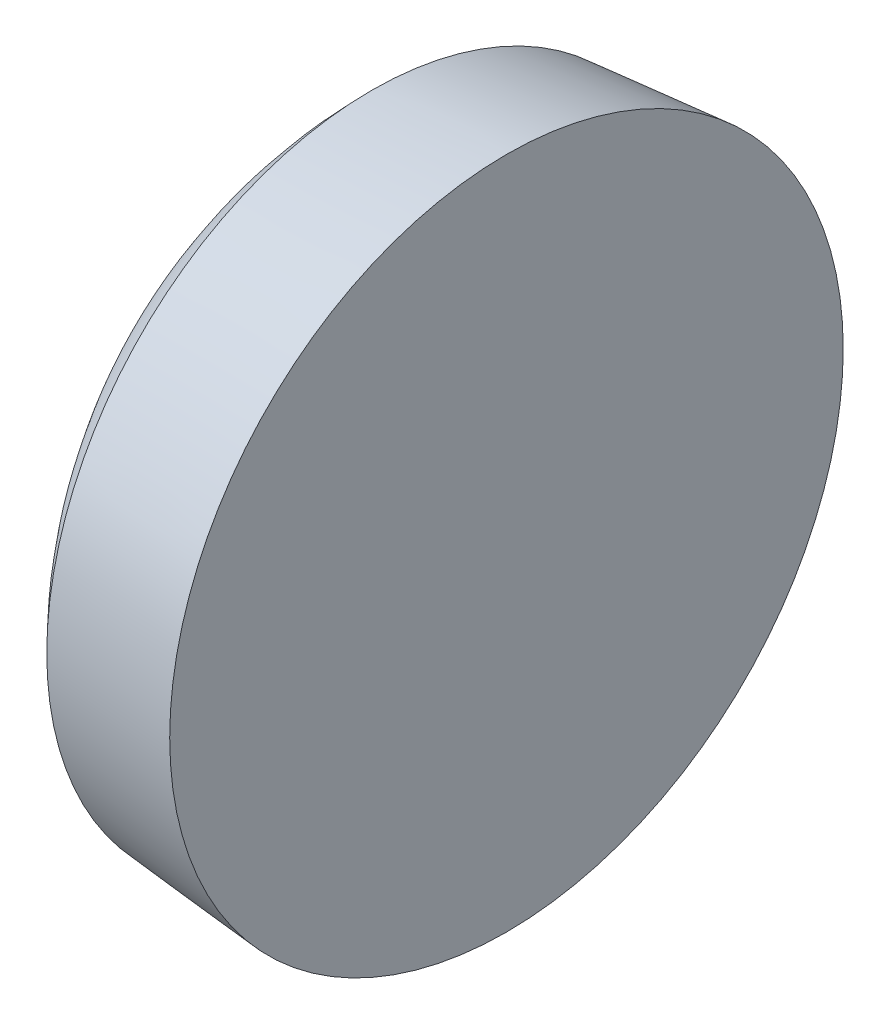
ISO-10303-21;
HEADER;
FILE_DESCRIPTION(('STEP AP214'),'2;1');
FILE_NAME('part.step','',(''),(''),'','','');
FILE_SCHEMA(('AUTOMOTIVE_DESIGN { 1 0 10303 214 1 1 1 1 }'));
ENDSEC;
DATA;
#1=APPLICATION_CONTEXT('core data for automotive mechanical design processes');
#2=APPLICATION_PROTOCOL_DEFINITION('international standard','automotive_design',2000,#1);
#3=PRODUCT_CONTEXT('',#1,'mechanical');
#4=PRODUCT('Part','Part','',(#3));
#5=PRODUCT_RELATED_PRODUCT_CATEGORY('part','',(#4));
#6=PRODUCT_DEFINITION_FORMATION('','',#4);
#7=PRODUCT_DEFINITION_CONTEXT('part definition',#1,'design');
#8=PRODUCT_DEFINITION('design','',#6,#7);
#9=PRODUCT_DEFINITION_SHAPE('','',#8);
#10=(LENGTH_UNIT() NAMED_UNIT(*) SI_UNIT(.MILLI.,.METRE.));
#11=(NAMED_UNIT(*) PLANE_ANGLE_UNIT() SI_UNIT($,.RADIAN.));
#12=(NAMED_UNIT(*) SI_UNIT($,.STERADIAN.) SOLID_ANGLE_UNIT());
#13=UNCERTAINTY_MEASURE_WITH_UNIT(LENGTH_MEASURE(1.E-05),#10,'distance_accuracy_value','');
#14=(GEOMETRIC_REPRESENTATION_CONTEXT(3) GLOBAL_UNCERTAINTY_ASSIGNED_CONTEXT((#13)) GLOBAL_UNIT_ASSIGNED_CONTEXT((#10,
#11,#12)) REPRESENTATION_CONTEXT('',''));
#15=CARTESIAN_POINT('',(0.,0.,0.));
#16=DIRECTION('',(0.,0.,1.));
#17=DIRECTION('',(1.,0.,0.));
#18=AXIS2_PLACEMENT_3D('',#15,#16,#17);
#19=CARTESIAN_POINT('',(183.433333333333,6.9,10.));
#20=DIRECTION('',(-1.,0.,0.));
#21=DIRECTION('',(0.,0.,1.));
#22=AXIS2_PLACEMENT_3D('',#19,#20,#21);
#23=PLANE('',#22);
#24=DIRECTION('',(0.,0.,-1.));
#25=VECTOR('',#24,1.);
#26=CARTESIAN_POINT('',(183.433333333333,7.85,10.));
#27=LINE('',#26,#25);
#28=CARTESIAN_POINT('',(183.433333333333,7.85,9.82));
#29=VERTEX_POINT('',#28);
#30=CARTESIAN_POINT('',(183.433333333333,7.85,10.18));
#31=VERTEX_POINT('',#30);
#32=EDGE_CURVE('E293',#29,#31,#27,.F.);
#33=ORIENTED_EDGE('',*,*,#32,.F.);
#34=DIRECTION('',(0.,1.,0.));
#35=VECTOR('',#34,1.);
#36=CARTESIAN_POINT('',(183.433333333333,6.9,9.82));
#37=LINE('',#36,#35);
#38=CARTESIAN_POINT('',(183.433333333333,7.08,9.82));
#39=VERTEX_POINT('',#38);
#40=EDGE_CURVE('E298',#39,#29,#37,.T.);
#41=ORIENTED_EDGE('',*,*,#40,.F.);
#42=DIRECTION('',(0.,0.,-1.));
#43=VECTOR('',#42,1.);
#44=CARTESIAN_POINT('',(183.433333333333,7.08,10.));
#45=LINE('',#44,#43);
#46=CARTESIAN_POINT('',(183.433333333333,7.08,9.05));
#47=VERTEX_POINT('',#46);
#48=EDGE_CURVE('E303',#47,#39,#45,.F.);
#49=ORIENTED_EDGE('',*,*,#48,.F.);
#50=DIRECTION('',(0.,1.,0.));
#51=VECTOR('',#50,1.);
#52=CARTESIAN_POINT('',(183.433333333333,6.9,9.05));
#53=LINE('',#52,#51);
#54=CARTESIAN_POINT('',(183.433333333333,6.72,9.05));
#55=VERTEX_POINT('',#54);
#56=EDGE_CURVE('E308',#55,#47,#53,.T.);
#57=ORIENTED_EDGE('',*,*,#56,.F.);
#58=DIRECTION('',(0.,0.,1.));
#59=VECTOR('',#58,1.);
#60=CARTESIAN_POINT('',(183.433333333333,6.72,10.));
#61=LINE('',#60,#59);
#62=CARTESIAN_POINT('',(183.433333333333,6.72,9.82));
#63=VERTEX_POINT('',#62);
#64=EDGE_CURVE('E313',#63,#55,#61,.F.);
#65=ORIENTED_EDGE('',*,*,#64,.F.);
#66=DIRECTION('',(0.,1.,0.));
#67=VECTOR('',#66,1.);
#68=CARTESIAN_POINT('',(183.433333333333,6.9,9.82));
#69=LINE('',#68,#67);
#70=CARTESIAN_POINT('',(183.433333333333,5.95,9.82));
#71=VERTEX_POINT('',#70);
#72=EDGE_CURVE('E318',#71,#63,#69,.T.);
#73=ORIENTED_EDGE('',*,*,#72,.F.);
#74=DIRECTION('',(0.,0.,-1.));
#75=VECTOR('',#74,1.);
#76=CARTESIAN_POINT('',(183.433333333333,5.95,10.));
#77=LINE('',#76,#75);
#78=CARTESIAN_POINT('',(183.433333333333,5.95,10.18));
#79=VERTEX_POINT('',#78);
#80=EDGE_CURVE('E267',#71,#79,#77,.F.);
#81=ORIENTED_EDGE('',*,*,#80,.T.);
#82=DIRECTION('',(0.,1.,0.));
#83=VECTOR('',#82,1.);
#84=CARTESIAN_POINT('',(183.433333333333,6.9,10.18));
#85=LINE('',#84,#83);
#86=CARTESIAN_POINT('',(183.433333333333,6.72,10.18));
#87=VERTEX_POINT('',#86);
#88=EDGE_CURVE('E264',#87,#79,#85,.F.);
#89=ORIENTED_EDGE('',*,*,#88,.F.);
#90=DIRECTION('',(0.,0.,1.));
#91=VECTOR('',#90,1.);
#92=CARTESIAN_POINT('',(183.433333333333,6.72,10.));
#93=LINE('',#92,#91);
#94=CARTESIAN_POINT('',(183.433333333333,6.72,10.95));
#95=VERTEX_POINT('',#94);
#96=EDGE_CURVE('E260',#95,#87,#93,.F.);
#97=ORIENTED_EDGE('',*,*,#96,.F.);
#98=DIRECTION('',(0.,1.,0.));
#99=VECTOR('',#98,1.);
#100=CARTESIAN_POINT('',(183.433333333333,6.9,10.95));
#101=LINE('',#100,#99);
#102=CARTESIAN_POINT('',(183.433333333333,7.08,10.95));
#103=VERTEX_POINT('',#102);
#104=EDGE_CURVE('E231',#95,#103,#101,.T.);
#105=ORIENTED_EDGE('',*,*,#104,.T.);
#106=DIRECTION('',(0.,0.,-1.));
#107=VECTOR('',#106,1.);
#108=CARTESIAN_POINT('',(183.433333333333,7.08,10.));
#109=LINE('',#108,#107);
#110=CARTESIAN_POINT('',(183.433333333333,7.08,10.18));
#111=VERTEX_POINT('',#110);
#112=EDGE_CURVE('E278',#111,#103,#109,.F.);
#113=ORIENTED_EDGE('',*,*,#112,.F.);
#114=DIRECTION('',(0.,1.,0.));
#115=VECTOR('',#114,1.);
#116=CARTESIAN_POINT('',(183.433333333333,6.9,10.18));
#117=LINE('',#116,#115);
#118=EDGE_CURVE('E288',#31,#111,#117,.F.);
#119=ORIENTED_EDGE('',*,*,#118,.F.);
#120=EDGE_LOOP('',(#33,#41,#49,#57,#65,#73,#81,#89,#97,#105,#113,#119));
#121=FACE_BOUND('',#120,.T.);
#122=ADVANCED_FACE('F17',(#121),#23,.T.);
#123=CARTESIAN_POINT('',(182.833333333333,6.72,10.));
#124=DIRECTION('',(0.,1.,0.));
#125=DIRECTION('',(0.,0.,1.));
#126=AXIS2_PLACEMENT_3D('',#123,#124,#125);
#127=PLANE('',#126);
#128=DIRECTION('',(1.,0.,0.));
#129=VECTOR('',#128,1.);
#130=CARTESIAN_POINT('',(182.833333333333,6.72,10.95));
#131=LINE('',#130,#129);
#132=CARTESIAN_POINT('',(182.410428810142,6.72,10.9499999999999));
#133=VERTEX_POINT('',#132);
#134=EDGE_CURVE('E89',#133,#95,#131,.T.);
#135=ORIENTED_EDGE('',*,*,#134,.T.);
#136=ORIENTED_EDGE('',*,*,#96,.T.);
#137=DIRECTION('',(-1.,0.,0.));
#138=VECTOR('',#137,1.);
#139=CARTESIAN_POINT('',(182.833333333333,6.72,10.18));
#140=LINE('',#139,#138);
#141=CARTESIAN_POINT('',(182.245235763539,6.72000000000002,10.18));
#142=VERTEX_POINT('',#141);
#143=EDGE_CURVE('E224',#142,#87,#140,.F.);
#144=ORIENTED_EDGE('',*,*,#143,.F.);
#145=CARTESIAN_POINT('',(182.410428810142,6.72,10.9499999999998));
#146=CARTESIAN_POINT('',(182.398883795949,6.72,10.9189995540504));
#147=CARTESIAN_POINT('',(182.387904413565,6.72,10.8877884938066));
#148=CARTESIAN_POINT('',(182.367131215027,6.72,10.8251104536467));
#149=CARTESIAN_POINT('',(182.357332908016,6.72,10.7936449620739));
#150=CARTESIAN_POINT('',(182.338909367376,6.72,10.7304618501355));
#151=CARTESIAN_POINT('',(182.330281127747,6.72,10.6987451062671));
#152=CARTESIAN_POINT('',(182.31418937858,6.72,10.6350619663154));
#153=CARTESIAN_POINT('',(182.306724349758,6.72,10.6030959541241));
#154=CARTESIAN_POINT('',(182.292955171372,6.72,10.5389148788567));
#155=CARTESIAN_POINT('',(182.286651021807,6.72,10.5066998157807));
#156=CARTESIAN_POINT('',(182.275204274441,6.72,10.4420201537523));
#157=CARTESIAN_POINT('',(182.270063219696,6.72,10.4095552817085));
#158=CARTESIAN_POINT('',(182.260948171023,6.72,10.3443751591892));
#159=CARTESIAN_POINT('',(182.256977278094,6.72,10.3116594750372));
#160=CARTESIAN_POINT('',(182.250212291185,6.72,10.2459761632456));
#161=CARTESIAN_POINT('',(182.247422903366,6.72,10.2130080508537));
#162=CARTESIAN_POINT('',(182.24523576354,6.72,10.18));
#163=B_SPLINE_CURVE_WITH_KNOTS('',3,(#145,#146,#147,#148,#149,#150,#151,#152,#153,#154,#155,
#156,#157,#158,#159,#160,#161,#162),.UNSPECIFIED.,.F.,.F.,(4,2,2,2,2,2,2,2,4),(0.,
0.099235744243404,0.198081387639238,0.296668072480432,0.39512489269402,0.493581712907609,
0.592168397748812,0.691014041144643,0.790249785388046),.UNSPECIFIED.);
#164=EDGE_CURVE('E20',#133,#142,#163,.T.);
#165=ORIENTED_EDGE('',*,*,#164,.F.);
#166=EDGE_LOOP('',(#135,#136,#144,#165));
#167=FACE_BOUND('',#166,.T.);
#168=ADVANCED_FACE('F221',(#167),#127,.T.);
#169=CARTESIAN_POINT('',(182.833333333333,6.9,10.18));
#170=DIRECTION('',(0.,0.,-1.));
#171=DIRECTION('',(-1.,0.,0.));
#172=AXIS2_PLACEMENT_3D('',#169,#170,#171);
#173=PLANE('',#172);
#174=ORIENTED_EDGE('',*,*,#88,.T.);
#175=DIRECTION('',(1.,0.,0.));
#176=VECTOR('',#175,1.);
#177=CARTESIAN_POINT('',(182.833333333333,5.95,10.18));
#178=LINE('',#177,#176);
#179=CARTESIAN_POINT('',(182.410428810142,5.95,10.18));
#180=VERTEX_POINT('',#179);
#181=EDGE_CURVE('E324',#79,#180,#178,.F.);
#182=ORIENTED_EDGE('',*,*,#181,.T.);
#183=CARTESIAN_POINT('',(182.24523576354,6.72000000000004,10.18));
#184=CARTESIAN_POINT('',(182.250889942228,6.63440991744424,10.18));
#185=CARTESIAN_POINT('',(182.260621429629,6.54909652262238,10.18));
#186=CARTESIAN_POINT('',(182.287988547145,6.3803409384024,10.18));
#187=CARTESIAN_POINT('',(182.305570101184,6.29688998051813,10.18));
#188=CARTESIAN_POINT('',(182.350299230746,6.12495750840967,10.18));
#189=CARTESIAN_POINT('',(182.378135293842,6.0366546889967,10.18));
#190=CARTESIAN_POINT('',(182.410428810142,5.95000000000018,10.18));
#191=B_SPLINE_CURVE_WITH_KNOTS('',3,(#183,#184,#185,#186,#187,#188,#189,#190),.UNSPECIFIED.,.F.,
.F.,(4,2,2,4),(0.,0.25722165882931,0.512698117737291,0.789983486231456),.UNSPECIFIED.);
#192=EDGE_CURVE('E213',#142,#180,#191,.T.);
#193=ORIENTED_EDGE('',*,*,#192,.F.);
#194=ORIENTED_EDGE('',*,*,#143,.T.);
#195=EDGE_LOOP('',(#174,#182,#193,#194));
#196=FACE_BOUND('',#195,.T.);
#197=ADVANCED_FACE('F204',(#196),#173,.T.);
#198=CARTESIAN_POINT('',(182.833333333333,5.95,10.));
#199=DIRECTION('',(0.,-1.,0.));
#200=DIRECTION('',(0.,0.,-1.));
#201=AXIS2_PLACEMENT_3D('',#198,#199,#200);
#202=PLANE('',#201);
#203=ORIENTED_EDGE('',*,*,#181,.F.);
#204=ORIENTED_EDGE('',*,*,#80,.F.);
#205=DIRECTION('',(1.,0.,0.));
#206=VECTOR('',#205,1.);
#207=CARTESIAN_POINT('',(182.833333333333,5.95,9.82));
#208=LINE('',#207,#206);
#209=CARTESIAN_POINT('',(182.410428810142,5.95000000000009,9.82));
#210=VERTEX_POINT('',#209);
#211=EDGE_CURVE('E320',#210,#71,#208,.T.);
#212=ORIENTED_EDGE('',*,*,#211,.F.);
#213=CARTESIAN_POINT('',(182.410428810143,5.95,10.18));
#214=CARTESIAN_POINT('',(182.406200414444,5.94999999999998,10.12));
#215=CARTESIAN_POINT('',(182.404086216595,5.94999999999998,10.06));
#216=CARTESIAN_POINT('',(182.404086216595,5.95000000000002,9.93999999999997));
#217=CARTESIAN_POINT('',(182.406200414444,5.95000000000006,9.87999999999998));
#218=CARTESIAN_POINT('',(182.410428810143,5.95000000000011,9.81999999999998));
#219=B_SPLINE_CURVE_WITH_KNOTS('',3,(#213,#214,#215,#216,#217,#218),.UNSPECIFIED.,.F.,.F.,(4,2,
4),(0.,0.180111711148681,0.36022342229736),.UNSPECIFIED.);
#220=EDGE_CURVE('E207',#180,#210,#219,.T.);
#221=ORIENTED_EDGE('',*,*,#220,.F.);
#222=EDGE_LOOP('',(#203,#204,#212,#221));
#223=FACE_BOUND('',#222,.T.);
#224=ADVANCED_FACE('F199',(#223),#202,.F.);
#225=CARTESIAN_POINT('',(182.833333333333,6.9,9.82));
#226=DIRECTION('',(0.,0.,1.));
#227=DIRECTION('',(1.,0.,0.));
#228=AXIS2_PLACEMENT_3D('',#225,#226,#227);
#229=PLANE('',#228);
#230=ORIENTED_EDGE('',*,*,#72,.T.);
#231=DIRECTION('',(1.,0.,0.));
#232=VECTOR('',#231,1.);
#233=CARTESIAN_POINT('',(182.833333333333,6.72,9.82));
#234=LINE('',#233,#232);
#235=CARTESIAN_POINT('',(182.245235763539,6.72,9.82000000000002));
#236=VERTEX_POINT('',#235);
#237=EDGE_CURVE('E315',#236,#63,#234,.T.);
#238=ORIENTED_EDGE('',*,*,#237,.F.);
#239=CARTESIAN_POINT('',(182.410428810142,5.95000000000019,9.82));
#240=CARTESIAN_POINT('',(182.398883795949,5.9810004459496,9.82));
#241=CARTESIAN_POINT('',(182.387904413565,6.01221150619345,9.82));
#242=CARTESIAN_POINT('',(182.367131215027,6.07488954635332,9.82));
#243=CARTESIAN_POINT('',(182.357332908016,6.10635503792611,9.82));
#244=CARTESIAN_POINT('',(182.338909367376,6.16953814986455,9.82));
#245=CARTESIAN_POINT('',(182.330281127747,6.2012548937329,9.82));
#246=CARTESIAN_POINT('',(182.31418937858,6.26493803368462,9.82));
#247=CARTESIAN_POINT('',(182.306724349758,6.29690404587594,9.82));
#248=CARTESIAN_POINT('',(182.292955171372,6.36108512114329,9.82));
#249=CARTESIAN_POINT('',(182.286651021807,6.39330018421931,9.82));
#250=CARTESIAN_POINT('',(182.275204274441,6.4579798462477,9.82));
#251=CARTESIAN_POINT('',(182.270063219696,6.49044471829152,9.82));
#252=CARTESIAN_POINT('',(182.260948171023,6.55562484081075,9.82));
#253=CARTESIAN_POINT('',(182.256977278094,6.58834052496283,9.82));
#254=CARTESIAN_POINT('',(182.250212291185,6.65402383675445,9.82));
#255=CARTESIAN_POINT('',(182.247422903366,6.68699194914626,9.82));
#256=CARTESIAN_POINT('',(182.24523576354,6.72000000000004,9.82));
#257=B_SPLINE_CURVE_WITH_KNOTS('',3,(#239,#240,#241,#242,#243,#244,#245,#246,#247,#248,#249,
#250,#251,#252,#253,#254,#255,#256),.UNSPECIFIED.,.F.,.F.,(4,2,2,2,2,2,2,2,4),(0.,
0.0992357442434024,0.198081387639237,0.296668072480432,0.395124892694019,0.493581712907605,
0.592168397748808,0.69101404114464,0.790249785388043),.UNSPECIFIED.);
#258=EDGE_CURVE('E184',#210,#236,#257,.T.);
#259=ORIENTED_EDGE('',*,*,#258,.F.);
#260=ORIENTED_EDGE('',*,*,#211,.T.);
#261=EDGE_LOOP('',(#230,#238,#259,#260));
#262=FACE_BOUND('',#261,.T.);
#263=ADVANCED_FACE('F194',(#262),#229,.T.);
#264=CARTESIAN_POINT('',(182.833333333333,6.72,10.));
#265=DIRECTION('',(0.,1.,0.));
#266=DIRECTION('',(0.,0.,1.));
#267=AXIS2_PLACEMENT_3D('',#264,#265,#266);
#268=PLANE('',#267);
#269=DIRECTION('',(1.,0.,0.));
#270=VECTOR('',#269,1.);
#271=CARTESIAN_POINT('',(182.833333333333,6.72,9.05));
#272=LINE('',#271,#270);
#273=CARTESIAN_POINT('',(182.410428810142,6.72,9.05));
#274=VERTEX_POINT('',#273);
#275=EDGE_CURVE('E310',#274,#55,#272,.T.);
#276=ORIENTED_EDGE('',*,*,#275,.F.);
#277=CARTESIAN_POINT('',(182.24523576354,6.72,9.82000000000004));
#278=CARTESIAN_POINT('',(182.250889942228,6.72,9.73440991744424));
#279=CARTESIAN_POINT('',(182.260621429629,6.72,9.64909652262238));
#280=CARTESIAN_POINT('',(182.287988547145,6.72,9.4803409384024));
#281=CARTESIAN_POINT('',(182.305570101184,6.72,9.39688998051814));
#282=CARTESIAN_POINT('',(182.350299230746,6.72,9.22495750840967));
#283=CARTESIAN_POINT('',(182.378135293842,6.72,9.1366546889967));
#284=CARTESIAN_POINT('',(182.410428810142,6.72,9.05000000000018));
#285=B_SPLINE_CURVE_WITH_KNOTS('',3,(#277,#278,#279,#280,#281,#282,#283,#284),.UNSPECIFIED.,.F.,
.F.,(4,2,2,4),(0.,0.257221658829309,0.51269811773729,0.78998348623146),.UNSPECIFIED.);
#286=EDGE_CURVE('E176',#236,#274,#285,.T.);
#287=ORIENTED_EDGE('',*,*,#286,.F.);
#288=ORIENTED_EDGE('',*,*,#237,.T.);
#289=ORIENTED_EDGE('',*,*,#64,.T.);
#290=EDGE_LOOP('',(#276,#287,#288,#289));
#291=FACE_BOUND('',#290,.T.);
#292=ADVANCED_FACE('F191',(#291),#268,.T.);
#293=CARTESIAN_POINT('',(182.833333333333,6.9,9.05));
#294=DIRECTION('',(0.,0.,1.));
#295=DIRECTION('',(1.,0.,0.));
#296=AXIS2_PLACEMENT_3D('',#293,#294,#295);
#297=PLANE('',#296);
#298=DIRECTION('',(1.,0.,0.));
#299=VECTOR('',#298,1.);
#300=CARTESIAN_POINT('',(182.833333333333,7.08,9.05));
#301=LINE('',#300,#299);
#302=CARTESIAN_POINT('',(182.410428810142,7.08,9.05000000000009));
#303=VERTEX_POINT('',#302);
#304=EDGE_CURVE('E305',#303,#47,#301,.T.);
#305=ORIENTED_EDGE('',*,*,#304,.F.);
#306=CARTESIAN_POINT('',(182.410428810142,7.08,9.05));
#307=CARTESIAN_POINT('',(182.404086216595,6.99011174581245,9.05));
#308=CARTESIAN_POINT('',(182.404086216595,6.9,9.05));
#309=B_SPLINE_CURVE_WITH_KNOTS('',2,(#306,#307,#308),.UNSPECIFIED.,.F.,.F.,(3,3),(0.,1.),.UNSPECIFIED.);
#310=CARTESIAN_POINT('',(182.404086216595,6.9,9.05));
#311=VERTEX_POINT('',#310);
#312=EDGE_CURVE('E175',#311,#303,#309,.F.);
#313=ORIENTED_EDGE('',*,*,#312,.F.);
#314=CARTESIAN_POINT('',(182.404086216595,6.9,9.05));
#315=CARTESIAN_POINT('',(182.404086216595,6.80988825418755,9.05));
#316=CARTESIAN_POINT('',(182.410428810142,6.72,9.05));
#317=B_SPLINE_CURVE_WITH_KNOTS('',2,(#314,#315,#316),.UNSPECIFIED.,.F.,.F.,(3,3),(0.,1.),.UNSPECIFIED.);
#318=EDGE_CURVE('E183',#274,#311,#317,.F.);
#319=ORIENTED_EDGE('',*,*,#318,.F.);
#320=ORIENTED_EDGE('',*,*,#275,.T.);
#321=ORIENTED_EDGE('',*,*,#56,.T.);
#322=EDGE_LOOP('',(#305,#313,#319,#320,#321));
#323=FACE_BOUND('',#322,.T.);
#324=ADVANCED_FACE('F164',(#323),#297,.T.);
#325=CARTESIAN_POINT('',(182.833333333333,7.08,10.));
#326=DIRECTION('',(0.,-1.,0.));
#327=DIRECTION('',(0.,0.,-1.));
#328=AXIS2_PLACEMENT_3D('',#325,#326,#327);
#329=PLANE('',#328);
#330=ORIENTED_EDGE('',*,*,#304,.T.);
#331=ORIENTED_EDGE('',*,*,#48,.T.);
#332=DIRECTION('',(1.,0.,0.));
#333=VECTOR('',#332,1.);
#334=CARTESIAN_POINT('',(182.833333333333,7.08,9.82));
#335=LINE('',#334,#333);
#336=CARTESIAN_POINT('',(182.245235763539,7.07999999999998,9.82));
#337=VERTEX_POINT('',#336);
#338=EDGE_CURVE('E300',#337,#39,#335,.T.);
#339=ORIENTED_EDGE('',*,*,#338,.F.);
#340=CARTESIAN_POINT('',(182.410428810142,7.08,9.05000000000018));
#341=CARTESIAN_POINT('',(182.398883795949,7.08,9.08100044594959));
#342=CARTESIAN_POINT('',(182.387904413565,7.08,9.11221150619344));
#343=CARTESIAN_POINT('',(182.367131215027,7.08,9.17488954635332));
#344=CARTESIAN_POINT('',(182.357332908016,7.08,9.20635503792611));
#345=CARTESIAN_POINT('',(182.338909367376,7.08,9.26953814986455));
#346=CARTESIAN_POINT('',(182.330281127747,7.08,9.30125489373289));
#347=CARTESIAN_POINT('',(182.31418937858,7.08,9.36493803368462));
#348=CARTESIAN_POINT('',(182.306724349758,7.08,9.39690404587594));
#349=CARTESIAN_POINT('',(182.292955171372,7.08,9.46108512114328));
#350=CARTESIAN_POINT('',(182.286651021807,7.08,9.49330018421931));
#351=CARTESIAN_POINT('',(182.275204274441,7.08,9.5579798462477));
#352=CARTESIAN_POINT('',(182.270063219696,7.08,9.59044471829151));
#353=CARTESIAN_POINT('',(182.260948171023,7.08,9.65562484081075));
#354=CARTESIAN_POINT('',(182.256977278094,7.08,9.68834052496283));
#355=CARTESIAN_POINT('',(182.250212291185,7.08,9.75402383675445));
#356=CARTESIAN_POINT('',(182.247422903366,7.08,9.78699194914626));
#357=CARTESIAN_POINT('',(182.24523576354,7.08,9.82000000000004));
#358=B_SPLINE_CURVE_WITH_KNOTS('',3,(#340,#341,#342,#343,#344,#345,#346,#347,#348,#349,#350,
#351,#352,#353,#354,#355,#356,#357),.UNSPECIFIED.,.F.,.F.,(4,2,2,2,2,2,2,2,4),(0.,
0.099235744243404,0.198081387639237,0.296668072480432,0.395124892694019,0.493581712907607,
0.59216839774881,0.691014041144642,0.790249785388045),.UNSPECIFIED.);
#359=EDGE_CURVE('E168',#303,#337,#358,.T.);
#360=ORIENTED_EDGE('',*,*,#359,.F.);
#361=EDGE_LOOP('',(#330,#331,#339,#360));
#362=FACE_BOUND('',#361,.T.);
#363=ADVANCED_FACE('F159',(#362),#329,.T.);
#364=CARTESIAN_POINT('',(182.833333333333,6.9,9.82));
#365=DIRECTION('',(0.,0.,1.));
#366=DIRECTION('',(1.,0.,0.));
#367=AXIS2_PLACEMENT_3D('',#364,#365,#366);
#368=PLANE('',#367);
#369=ORIENTED_EDGE('',*,*,#40,.T.);
#370=DIRECTION('',(1.,0.,0.));
#371=VECTOR('',#370,1.);
#372=CARTESIAN_POINT('',(182.833333333333,7.85,9.82));
#373=LINE('',#372,#371);
#374=CARTESIAN_POINT('',(182.410428810142,7.85,9.82000000000002));
#375=VERTEX_POINT('',#374);
#376=EDGE_CURVE('E295',#375,#29,#373,.T.);
#377=ORIENTED_EDGE('',*,*,#376,.F.);
#378=CARTESIAN_POINT('',(182.24523576354,7.07999999999996,9.82));
#379=CARTESIAN_POINT('',(182.250889942228,7.16559008255576,9.82));
#380=CARTESIAN_POINT('',(182.260621429629,7.25090347737762,9.82));
#381=CARTESIAN_POINT('',(182.287988547145,7.4196590615976,9.82));
#382=CARTESIAN_POINT('',(182.305570101184,7.50311001948186,9.82));
#383=CARTESIAN_POINT('',(182.350299230746,7.67504249159033,9.82));
#384=CARTESIAN_POINT('',(182.378135293842,7.7633453110033,9.82));
#385=CARTESIAN_POINT('',(182.410428810142,7.84999999999982,9.82));
#386=B_SPLINE_CURVE_WITH_KNOTS('',3,(#378,#379,#380,#381,#382,#383,#384,#385),.UNSPECIFIED.,.F.,
.F.,(4,2,2,4),(0.,0.25722165882931,0.51269811773729,0.789983486231458),.UNSPECIFIED.);
#387=EDGE_CURVE('E144',#337,#375,#386,.T.);
#388=ORIENTED_EDGE('',*,*,#387,.F.);
#389=ORIENTED_EDGE('',*,*,#338,.T.);
#390=EDGE_LOOP('',(#369,#377,#388,#389));
#391=FACE_BOUND('',#390,.T.);
#392=ADVANCED_FACE('F154',(#391),#368,.T.);
#393=CARTESIAN_POINT('',(182.833333333333,7.85,10.));
#394=DIRECTION('',(0.,-1.,0.));
#395=DIRECTION('',(0.,0.,-1.));
#396=AXIS2_PLACEMENT_3D('',#393,#394,#395);
#397=PLANE('',#396);
#398=ORIENTED_EDGE('',*,*,#32,.T.);
#399=DIRECTION('',(-1.,0.,0.));
#400=VECTOR('',#399,1.);
#401=CARTESIAN_POINT('',(182.833333333333,7.85,10.18));
#402=LINE('',#401,#400);
#403=CARTESIAN_POINT('',(182.410428810142,7.84999999999991,10.18));
#404=VERTEX_POINT('',#403);
#405=EDGE_CURVE('E290',#404,#31,#402,.F.);
#406=ORIENTED_EDGE('',*,*,#405,.F.);
#407=CARTESIAN_POINT('',(182.410428810143,7.85,9.82000000000004));
#408=CARTESIAN_POINT('',(182.406200414444,7.85000000000001,9.88000000000004));
#409=CARTESIAN_POINT('',(182.404086216595,7.85000000000001,9.94000000000003));
#410=CARTESIAN_POINT('',(182.404086216595,7.84999999999999,10.06));
#411=CARTESIAN_POINT('',(182.406200414444,7.84999999999997,10.12));
#412=CARTESIAN_POINT('',(182.410428810143,7.84999999999994,10.18));
#413=B_SPLINE_CURVE_WITH_KNOTS('',3,(#407,#408,#409,#410,#411,#412),.UNSPECIFIED.,.F.,.F.,(4,2,
4),(0.,0.180111711148681,0.36022342229736),.UNSPECIFIED.);
#414=EDGE_CURVE('E137',#375,#404,#413,.T.);
#415=ORIENTED_EDGE('',*,*,#414,.F.);
#416=ORIENTED_EDGE('',*,*,#376,.T.);
#417=EDGE_LOOP('',(#398,#406,#415,#416));
#418=FACE_BOUND('',#417,.T.);
#419=ADVANCED_FACE('F151',(#418),#397,.T.);
#420=CARTESIAN_POINT('',(182.833333333333,6.9,10.18));
#421=DIRECTION('',(0.,0.,-1.));
#422=DIRECTION('',(-1.,0.,0.));
#423=AXIS2_PLACEMENT_3D('',#420,#421,#422);
#424=PLANE('',#423);
#425=ORIENTED_EDGE('',*,*,#118,.T.);
#426=DIRECTION('',(1.,0.,0.));
#427=VECTOR('',#426,1.);
#428=CARTESIAN_POINT('',(182.833333333333,7.08,10.18));
#429=LINE('',#428,#427);
#430=CARTESIAN_POINT('',(182.245235763539,7.08,10.18));
#431=VERTEX_POINT('',#430);
#432=EDGE_CURVE('E280',#431,#111,#429,.T.);
#433=ORIENTED_EDGE('',*,*,#432,.F.);
#434=CARTESIAN_POINT('',(182.410428810142,7.84999999999982,10.18));
#435=CARTESIAN_POINT('',(182.398883795949,7.8189995540504,10.18));
#436=CARTESIAN_POINT('',(182.387904413565,7.78778849380655,10.18));
#437=CARTESIAN_POINT('',(182.367131215027,7.72511045364668,10.18));
#438=CARTESIAN_POINT('',(182.357332908016,7.69364496207389,10.18));
#439=CARTESIAN_POINT('',(182.338909367376,7.63046185013545,10.18));
#440=CARTESIAN_POINT('',(182.330281127747,7.59874510626711,10.18));
#441=CARTESIAN_POINT('',(182.31418937858,7.53506196631538,10.18));
#442=CARTESIAN_POINT('',(182.306724349758,7.50309595412406,10.18));
#443=CARTESIAN_POINT('',(182.292955171372,7.43891487885671,10.18));
#444=CARTESIAN_POINT('',(182.286651021807,7.40669981578069,10.18));
#445=CARTESIAN_POINT('',(182.275204274441,7.3420201537523,10.18));
#446=CARTESIAN_POINT('',(182.270063219696,7.30955528170849,10.18));
#447=CARTESIAN_POINT('',(182.260948171023,7.24437515918925,10.18));
#448=CARTESIAN_POINT('',(182.256977278094,7.21165947503717,10.18));
#449=CARTESIAN_POINT('',(182.250212291185,7.14597616324555,10.18));
#450=CARTESIAN_POINT('',(182.247422903366,7.11300805085374,10.18));
#451=CARTESIAN_POINT('',(182.24523576354,7.07999999999996,10.18));
#452=B_SPLINE_CURVE_WITH_KNOTS('',3,(#434,#435,#436,#437,#438,#439,#440,#441,#442,#443,#444,
#445,#446,#447,#448,#449,#450,#451),.UNSPECIFIED.,.F.,.F.,(4,2,2,2,2,2,2,2,4),(0.,
0.0992357442434024,0.198081387639237,0.296668072480432,0.395124892694019,0.493581712907606,
0.592168397748809,0.691014041144642,0.790249785388044),.UNSPECIFIED.);
#453=EDGE_CURVE('E100',#404,#431,#452,.T.);
#454=ORIENTED_EDGE('',*,*,#453,.F.);
#455=ORIENTED_EDGE('',*,*,#405,.T.);
#456=EDGE_LOOP('',(#425,#433,#454,#455));
#457=FACE_BOUND('',#456,.T.);
#458=ADVANCED_FACE('F123',(#457),#424,.T.);
#459=CARTESIAN_POINT('',(182.833333333333,7.08,10.));
#460=DIRECTION('',(0.,-1.,0.));
#461=DIRECTION('',(0.,0.,-1.));
#462=AXIS2_PLACEMENT_3D('',#459,#460,#461);
#463=PLANE('',#462);
#464=DIRECTION('',(1.,0.,0.));
#465=VECTOR('',#464,1.);
#466=CARTESIAN_POINT('',(182.833333333333,7.08,10.95));
#467=LINE('',#466,#465);
#468=CARTESIAN_POINT('',(182.410428810142,7.08,10.95));
#469=VERTEX_POINT('',#468);
#470=EDGE_CURVE('E40',#103,#469,#467,.F.);
#471=ORIENTED_EDGE('',*,*,#470,.T.);
#472=CARTESIAN_POINT('',(182.24523576354,7.08,10.18));
#473=CARTESIAN_POINT('',(182.250889942228,7.08,10.2655900825558));
#474=CARTESIAN_POINT('',(182.260621429629,7.08,10.3509034773776));
#475=CARTESIAN_POINT('',(182.287988547145,7.08,10.5196590615976));
#476=CARTESIAN_POINT('',(182.305570101184,7.08,10.6031100194819));
#477=CARTESIAN_POINT('',(182.350299230746,7.08,10.7750424915903));
#478=CARTESIAN_POINT('',(182.378135293842,7.08,10.8633453110033));
#479=CARTESIAN_POINT('',(182.410428810142,7.08,10.9499999999998));
#480=B_SPLINE_CURVE_WITH_KNOTS('',3,(#472,#473,#474,#475,#476,#477,#478,#479),.UNSPECIFIED.,.F.,
.F.,(4,2,2,4),(0.,0.257221658829309,0.51269811773729,0.789983486231462),.UNSPECIFIED.);
#481=EDGE_CURVE('E96',#431,#469,#480,.T.);
#482=ORIENTED_EDGE('',*,*,#481,.F.);
#483=ORIENTED_EDGE('',*,*,#432,.T.);
#484=ORIENTED_EDGE('',*,*,#112,.T.);
#485=EDGE_LOOP('',(#471,#482,#483,#484));
#486=FACE_BOUND('',#485,.T.);
#487=ADVANCED_FACE('F115',(#486),#463,.T.);
#488=CARTESIAN_POINT('',(182.833333333333,6.9,10.95));
#489=DIRECTION('',(0.,0.,1.));
#490=DIRECTION('',(1.,0.,0.));
#491=AXIS2_PLACEMENT_3D('',#488,#489,#490);
#492=PLANE('',#491);
#493=ORIENTED_EDGE('',*,*,#470,.F.);
#494=ORIENTED_EDGE('',*,*,#104,.F.);
#495=ORIENTED_EDGE('',*,*,#134,.F.);
#496=CARTESIAN_POINT('',(182.404086216595,6.9,10.95));
#497=CARTESIAN_POINT('',(182.404086216595,6.80988825418755,10.95));
#498=CARTESIAN_POINT('',(182.410428810142,6.72,10.95));
#499=B_SPLINE_CURVE_WITH_KNOTS('',2,(#496,#497,#498),.UNSPECIFIED.,.F.,.F.,(3,3),(0.,1.),.UNSPECIFIED.);
#500=CARTESIAN_POINT('',(182.404086216595,6.9,10.95));
#501=VERTEX_POINT('',#500);
#502=EDGE_CURVE('E82',#501,#133,#499,.T.);
#503=ORIENTED_EDGE('',*,*,#502,.F.);
#504=CARTESIAN_POINT('',(182.410428810142,7.08,10.95));
#505=CARTESIAN_POINT('',(182.404086216595,6.99011174581245,10.95));
#506=CARTESIAN_POINT('',(182.404086216595,6.9,10.95));
#507=B_SPLINE_CURVE_WITH_KNOTS('',2,(#504,#505,#506),.UNSPECIFIED.,.F.,.F.,(3,3),(0.,1.),.UNSPECIFIED.);
#508=EDGE_CURVE('E85',#469,#501,#507,.T.);
#509=ORIENTED_EDGE('',*,*,#508,.F.);
#510=EDGE_LOOP('',(#493,#494,#495,#503,#509));
#511=FACE_BOUND('',#510,.T.);
#512=ADVANCED_FACE('F84',(#511),#492,.F.);
#513=CARTESIAN_POINT('',(184.96141771278,6.9,10.));
#514=DIRECTION('',(1.,0.,0.));
#515=DIRECTION('',(0.,1.,0.));
#516=AXIS2_PLACEMENT_3D('',#513,#514,#515);
#517=SPHERICAL_SURFACE('',#516,2.72808437944638);
#518=CARTESIAN_POINT('',(183.033333333356,6.9,10.));
#519=DIRECTION('',(1.,0.,0.));
#520=DIRECTION('',(0.,0.,1.));
#521=AXIS2_PLACEMENT_3D('',#518,#519,#520);
#522=CIRCLE('',#521,1.9300090691894);
#523=CARTESIAN_POINT('',(183.033333333356,6.90000000000007,11.9300090691894));
#524=VERTEX_POINT('',#523);
#525=EDGE_CURVE('E31',#524,#524,#522,.T.);
#526=ORIENTED_EDGE('',*,*,#525,.F.);
#527=EDGE_LOOP('',(#526));
#528=FACE_BOUND('',#527,.T.);
#529=ORIENTED_EDGE('',*,*,#481,.T.);
#530=ORIENTED_EDGE('',*,*,#508,.T.);
#531=ORIENTED_EDGE('',*,*,#502,.T.);
#532=ORIENTED_EDGE('',*,*,#164,.T.);
#533=ORIENTED_EDGE('',*,*,#192,.T.);
#534=ORIENTED_EDGE('',*,*,#220,.T.);
#535=ORIENTED_EDGE('',*,*,#258,.T.);
#536=ORIENTED_EDGE('',*,*,#286,.T.);
#537=ORIENTED_EDGE('',*,*,#318,.T.);
#538=ORIENTED_EDGE('',*,*,#312,.T.);
#539=ORIENTED_EDGE('',*,*,#359,.T.);
#540=ORIENTED_EDGE('',*,*,#387,.T.);
#541=ORIENTED_EDGE('',*,*,#414,.T.);
#542=ORIENTED_EDGE('',*,*,#453,.T.);
#543=EDGE_LOOP('',(#529,#530,#531,#532,#533,#534,#535,#536,#537,#538,#539,#540,#541,#542));
#544=FACE_BOUND('',#543,.T.);
#545=ADVANCED_FACE('F94',(#528,#544),#517,.T.);
#546=CARTESIAN_POINT('',(183.833333333325,6.9,10.));
#547=DIRECTION('',(1.,0.,0.));
#548=DIRECTION('',(0.,0.,-1.));
#549=AXIS2_PLACEMENT_3D('',#546,#547,#548);
#550=CONICAL_SURFACE('',#549,2.00000000000045,0.0872664625936403);
#551=CARTESIAN_POINT('',(183.833333333325,6.9,10.));
#552=DIRECTION('',(1.,0.,0.));
#553=DIRECTION('',(0.,0.,-1.));
#554=AXIS2_PLACEMENT_3D('',#551,#552,#553);
#555=CIRCLE('',#554,2.00000000000045);
#556=CARTESIAN_POINT('',(183.833333333325,6.9,7.99999999999955));
#557=VERTEX_POINT('',#556);
#558=EDGE_CURVE('E11',#557,#557,#555,.T.);
#559=ORIENTED_EDGE('',*,*,#558,.F.);
#560=EDGE_LOOP('',(#559));
#561=FACE_BOUND('',#560,.T.);
#562=ORIENTED_EDGE('',*,*,#525,.T.);
#563=EDGE_LOOP('',(#562));
#564=FACE_BOUND('',#563,.T.);
#565=ADVANCED_FACE('F402',(#561,#564),#550,.T.);
#566=CARTESIAN_POINT('',(183.833333333333,6.9,11.));
#567=DIRECTION('',(1.,0.,0.));
#568=DIRECTION('',(0.,0.,-1.));
#569=AXIS2_PLACEMENT_3D('',#566,#567,#568);
#570=PLANE('',#569);
#571=ORIENTED_EDGE('',*,*,#558,.T.);
#572=EDGE_LOOP('',(#571));
#573=FACE_BOUND('',#572,.T.);
#574=ADVANCED_FACE('F400',(#573),#570,.T.);
#575=CLOSED_SHELL('',(#122,#168,#197,#224,#263,#292,#324,#363,#392,#419,#458,#487,#512,#545,
#565,#574));
#576=MANIFOLD_SOLID_BREP('B1',#575);
#577=ADVANCED_BREP_SHAPE_REPRESENTATION('',(#18,#576),#14);
#578=SHAPE_DEFINITION_REPRESENTATION(#9,#577);
ENDSEC;
END-ISO-10303-21;
